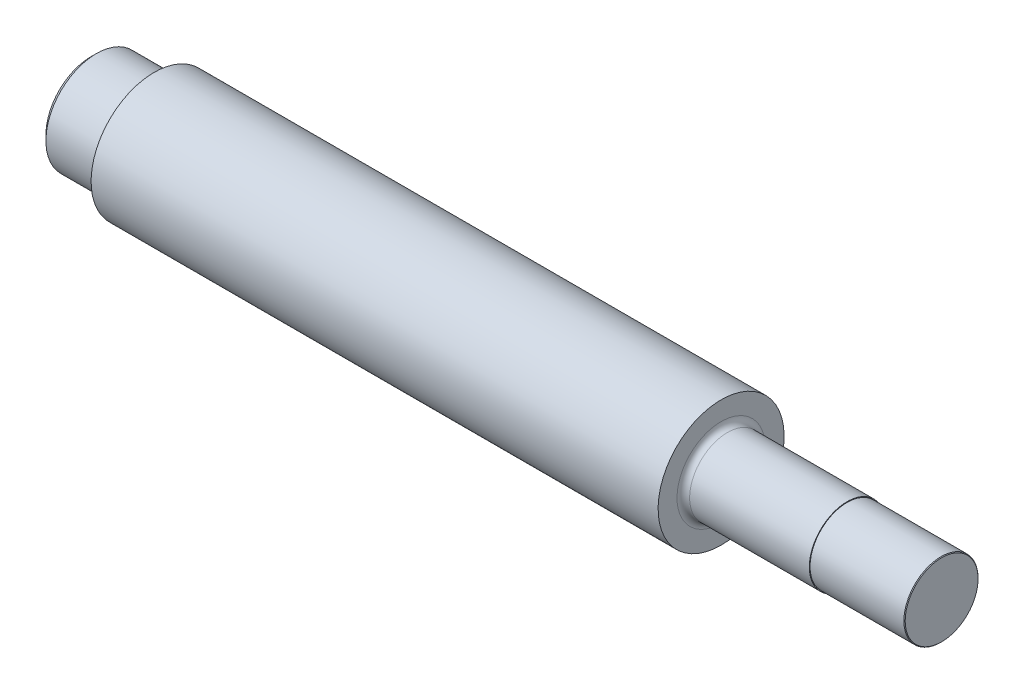
ISO-10303-21;
HEADER;
FILE_DESCRIPTION(('STEP AP214'),'2;1');
FILE_NAME('part.step','',(''),(''),'','','');
FILE_SCHEMA(('AUTOMOTIVE_DESIGN { 1 0 10303 214 1 1 1 1 }'));
ENDSEC;
DATA;
#1=APPLICATION_CONTEXT('core data for automotive mechanical design processes');
#2=APPLICATION_PROTOCOL_DEFINITION('international standard','automotive_design',2000,#1);
#3=PRODUCT_CONTEXT('',#1,'mechanical');
#4=PRODUCT('Part','Part','',(#3));
#5=PRODUCT_RELATED_PRODUCT_CATEGORY('part','',(#4));
#6=PRODUCT_DEFINITION_FORMATION('','',#4);
#7=PRODUCT_DEFINITION_CONTEXT('part definition',#1,'design');
#8=PRODUCT_DEFINITION('design','',#6,#7);
#9=PRODUCT_DEFINITION_SHAPE('','',#8);
#10=(LENGTH_UNIT() NAMED_UNIT(*) SI_UNIT(.MILLI.,.METRE.));
#11=(NAMED_UNIT(*) PLANE_ANGLE_UNIT() SI_UNIT($,.RADIAN.));
#12=(NAMED_UNIT(*) SI_UNIT($,.STERADIAN.) SOLID_ANGLE_UNIT());
#13=UNCERTAINTY_MEASURE_WITH_UNIT(LENGTH_MEASURE(1.E-05),#10,'distance_accuracy_value','');
#14=(GEOMETRIC_REPRESENTATION_CONTEXT(3) GLOBAL_UNCERTAINTY_ASSIGNED_CONTEXT((#13)) GLOBAL_UNIT_ASSIGNED_CONTEXT((#10,
#11,#12)) REPRESENTATION_CONTEXT('',''));
#15=CARTESIAN_POINT('',(0.,0.,0.));
#16=DIRECTION('',(0.,0.,1.));
#17=DIRECTION('',(1.,0.,0.));
#18=AXIS2_PLACEMENT_3D('',#15,#16,#17);
#19=CARTESIAN_POINT('',(-91.494037708377,0.,0.));
#20=DIRECTION('',(-1.,0.,0.));
#21=DIRECTION('',(0.,-1.,0.));
#22=AXIS2_PLACEMENT_3D('',#19,#20,#21);
#23=CYLINDRICAL_SURFACE('',#22,10.);
#24=CARTESIAN_POINT('',(-81.494037708377,0.,0.));
#25=DIRECTION('',(1.,0.,0.));
#26=DIRECTION('',(0.,0.,-1.));
#27=AXIS2_PLACEMENT_3D('',#24,#25,#26);
#28=CIRCLE('',#27,9.99999999999999);
#29=CARTESIAN_POINT('',(-81.494037708377,0.,-9.99999999999999));
#30=VERTEX_POINT('',#29);
#31=EDGE_CURVE('E89',#30,#30,#28,.T.);
#32=ORIENTED_EDGE('',*,*,#31,.T.);
#33=EDGE_LOOP('',(#32));
#34=FACE_BOUND('',#33,.T.);
#35=CARTESIAN_POINT('',(8.50596229162298,0.,0.));
#36=DIRECTION('',(-1.,0.,0.));
#37=DIRECTION('',(0.,-1.,0.));
#38=AXIS2_PLACEMENT_3D('',#35,#36,#37);
#39=CIRCLE('',#38,10.);
#40=CARTESIAN_POINT('',(8.50596229162298,-10.,0.));
#41=VERTEX_POINT('',#40);
#42=EDGE_CURVE('E60',#41,#41,#39,.T.);
#43=ORIENTED_EDGE('',*,*,#42,.T.);
#44=EDGE_LOOP('',(#43));
#45=FACE_BOUND('',#44,.T.);
#46=ADVANCED_FACE('F45',(#34,#45),#23,.T.);
#47=CARTESIAN_POINT('',(8.50596229162299,10.,0.));
#48=DIRECTION('',(-1.,0.,0.));
#49=DIRECTION('',(0.,-1.,0.));
#50=AXIS2_PLACEMENT_3D('',#47,#48,#49);
#51=PLANE('',#50);
#52=CARTESIAN_POINT('',(8.50596229162299,0.,0.));
#53=DIRECTION('',(-1.,0.,0.));
#54=DIRECTION('',(0.,-1.,0.));
#55=AXIS2_PLACEMENT_3D('',#52,#53,#54);
#56=CIRCLE('',#55,7.00000000000001);
#57=CARTESIAN_POINT('',(8.50596229162299,-6.99999999999999,0.));
#58=VERTEX_POINT('',#57);
#59=EDGE_CURVE('E53',#58,#58,#56,.T.);
#60=ORIENTED_EDGE('',*,*,#59,.T.);
#61=EDGE_LOOP('',(#60));
#62=FACE_BOUND('',#61,.T.);
#63=ORIENTED_EDGE('',*,*,#42,.F.);
#64=EDGE_LOOP('',(#63));
#65=FACE_BOUND('',#64,.T.);
#66=ADVANCED_FACE('F119',(#62,#65),#51,.F.);
#67=CARTESIAN_POINT('',(-91.494037708377,0.,0.));
#68=DIRECTION('',(-1.,0.,0.));
#69=DIRECTION('',(0.,-1.,0.));
#70=AXIS2_PLACEMENT_3D('',#67,#68,#69);
#71=CYLINDRICAL_SURFACE('',#70,6.00000000000001);
#72=CARTESIAN_POINT('',(28.505962291623,0.,0.));
#73=DIRECTION('',(-1.,0.,0.));
#74=DIRECTION('',(0.,0.,1.));
#75=AXIS2_PLACEMENT_3D('',#72,#73,#74);
#76=CIRCLE('',#75,6.);
#77=CARTESIAN_POINT('',(28.505962291623,0.,6.));
#78=VERTEX_POINT('',#77);
#79=EDGE_CURVE('E73',#78,#78,#76,.T.);
#80=ORIENTED_EDGE('',*,*,#79,.T.);
#81=EDGE_LOOP('',(#80));
#82=FACE_BOUND('',#81,.T.);
#83=CARTESIAN_POINT('',(9.50596229162298,0.,0.));
#84=DIRECTION('',(-1.,0.,0.));
#85=DIRECTION('',(0.,-1.,0.));
#86=AXIS2_PLACEMENT_3D('',#83,#84,#85);
#87=CIRCLE('',#86,6.00000000000001);
#88=CARTESIAN_POINT('',(9.50596229162298,-5.99999999999999,0.));
#89=VERTEX_POINT('',#88);
#90=EDGE_CURVE('E10',#89,#89,#87,.F.);
#91=ORIENTED_EDGE('',*,*,#90,.T.);
#92=EDGE_LOOP('',(#91));
#93=FACE_BOUND('',#92,.T.);
#94=ADVANCED_FACE('F124',(#82,#93),#71,.T.);
#95=CARTESIAN_POINT('',(9.50596229162298,0.,0.));
#96=DIRECTION('',(-1.,0.,0.));
#97=DIRECTION('',(0.,-1.,0.));
#98=AXIS2_PLACEMENT_3D('',#95,#96,#97);
#99=TOROIDAL_SURFACE('',#98,7.00000000000001,1.);
#100=ORIENTED_EDGE('',*,*,#90,.F.);
#101=EDGE_LOOP('',(#100));
#102=FACE_BOUND('',#101,.T.);
#103=ORIENTED_EDGE('',*,*,#59,.F.);
#104=EDGE_LOOP('',(#103));
#105=FACE_BOUND('',#104,.T.);
#106=ADVANCED_FACE('F47',(#102,#105),#99,.F.);
#107=CARTESIAN_POINT('',(43.505962291623,0.,0.));
#108=DIRECTION('',(-1.,0.,0.));
#109=DIRECTION('',(0.,0.,1.));
#110=AXIS2_PLACEMENT_3D('',#107,#108,#109);
#111=CYLINDRICAL_SURFACE('',#110,5.8865);
#112=CARTESIAN_POINT('',(28.505962291623,0.,0.));
#113=DIRECTION('',(-1.,0.,0.));
#114=DIRECTION('',(0.,0.,1.));
#115=AXIS2_PLACEMENT_3D('',#112,#113,#114);
#116=CIRCLE('',#115,5.8865);
#117=CARTESIAN_POINT('',(28.505962291623,0.,5.8865));
#118=VERTEX_POINT('',#117);
#119=EDGE_CURVE('E67',#118,#118,#116,.T.);
#120=ORIENTED_EDGE('',*,*,#119,.F.);
#121=EDGE_LOOP('',(#120));
#122=FACE_BOUND('',#121,.T.);
#123=CARTESIAN_POINT('',(43.404962291623,0.,0.));
#124=DIRECTION('',(-1.,0.,0.));
#125=DIRECTION('',(0.,0.,1.));
#126=AXIS2_PLACEMENT_3D('',#123,#124,#125);
#127=CIRCLE('',#126,5.8865);
#128=CARTESIAN_POINT('',(43.404962291623,0.,5.8865));
#129=VERTEX_POINT('',#128);
#130=EDGE_CURVE('E81',#129,#129,#127,.T.);
#131=ORIENTED_EDGE('',*,*,#130,.T.);
#132=EDGE_LOOP('',(#131));
#133=FACE_BOUND('',#132,.T.);
#134=ADVANCED_FACE('F136',(#122,#133),#111,.T.);
#135=CARTESIAN_POINT('',(28.505962291623,5.88650000000002,0.));
#136=DIRECTION('',(-1.,0.,0.));
#137=DIRECTION('',(0.,0.,1.));
#138=AXIS2_PLACEMENT_3D('',#135,#136,#137);
#139=PLANE('',#138);
#140=ORIENTED_EDGE('',*,*,#79,.F.);
#141=EDGE_LOOP('',(#140));
#142=FACE_BOUND('',#141,.T.);
#143=ORIENTED_EDGE('',*,*,#119,.T.);
#144=EDGE_LOOP('',(#143));
#145=FACE_BOUND('',#144,.T.);
#146=ADVANCED_FACE('F139',(#142,#145),#139,.F.);
#147=CARTESIAN_POINT('',(43.505962291623,0.,0.));
#148=DIRECTION('',(-1.,0.,0.));
#149=DIRECTION('',(0.,0.,1.));
#150=AXIS2_PLACEMENT_3D('',#147,#148,#149);
#151=CONICAL_SURFACE('',#150,5.7855,0.785398163397457);
#152=ORIENTED_EDGE('',*,*,#130,.F.);
#153=EDGE_LOOP('',(#152));
#154=FACE_BOUND('',#153,.T.);
#155=CARTESIAN_POINT('',(43.505962291623,0.,0.));
#156=DIRECTION('',(-1.,0.,0.));
#157=DIRECTION('',(0.,0.,1.));
#158=AXIS2_PLACEMENT_3D('',#155,#156,#157);
#159=CIRCLE('',#158,5.7855);
#160=CARTESIAN_POINT('',(43.505962291623,0.,5.7855));
#161=VERTEX_POINT('',#160);
#162=EDGE_CURVE('E77',#161,#161,#159,.T.);
#163=ORIENTED_EDGE('',*,*,#162,.T.);
#164=EDGE_LOOP('',(#163));
#165=FACE_BOUND('',#164,.T.);
#166=ADVANCED_FACE('F134',(#154,#165),#151,.T.);
#167=CARTESIAN_POINT('',(43.505962291623,6.00000000000002,0.));
#168=DIRECTION('',(-1.,0.,0.));
#169=DIRECTION('',(0.,-1.,0.));
#170=AXIS2_PLACEMENT_3D('',#167,#168,#169);
#171=PLANE('',#170);
#172=ORIENTED_EDGE('',*,*,#162,.F.);
#173=EDGE_LOOP('',(#172));
#174=FACE_BOUND('',#173,.T.);
#175=ADVANCED_FACE('F131',(#174),#171,.F.);
#176=CARTESIAN_POINT('',(-91.494037708377,0.,0.));
#177=DIRECTION('',(1.,0.,0.));
#178=DIRECTION('',(0.,0.,-1.));
#179=AXIS2_PLACEMENT_3D('',#176,#177,#178);
#180=CYLINDRICAL_SURFACE('',#179,8.);
#181=CARTESIAN_POINT('',(-81.494037708377,0.,0.));
#182=DIRECTION('',(1.,0.,0.));
#183=DIRECTION('',(0.,0.,-1.));
#184=AXIS2_PLACEMENT_3D('',#181,#182,#183);
#185=CIRCLE('',#184,8.);
#186=CARTESIAN_POINT('',(-81.494037708377,0.,-8.));
#187=VERTEX_POINT('',#186);
#188=EDGE_CURVE('E85',#187,#187,#185,.T.);
#189=ORIENTED_EDGE('',*,*,#188,.F.);
#190=EDGE_LOOP('',(#189));
#191=FACE_BOUND('',#190,.T.);
#192=CARTESIAN_POINT('',(-90.666037708377,0.,0.));
#193=DIRECTION('',(1.,0.,0.));
#194=DIRECTION('',(0.,0.,-1.));
#195=AXIS2_PLACEMENT_3D('',#192,#193,#194);
#196=CIRCLE('',#195,8.);
#197=CARTESIAN_POINT('',(-90.666037708377,0.,-8.));
#198=VERTEX_POINT('',#197);
#199=EDGE_CURVE('E97',#198,#198,#196,.T.);
#200=ORIENTED_EDGE('',*,*,#199,.T.);
#201=EDGE_LOOP('',(#200));
#202=FACE_BOUND('',#201,.T.);
#203=ADVANCED_FACE('F104',(#191,#202),#180,.T.);
#204=CARTESIAN_POINT('',(-81.494037708377,8.,0.));
#205=DIRECTION('',(1.,0.,0.));
#206=DIRECTION('',(0.,0.,-1.));
#207=AXIS2_PLACEMENT_3D('',#204,#205,#206);
#208=PLANE('',#207);
#209=ORIENTED_EDGE('',*,*,#31,.F.);
#210=EDGE_LOOP('',(#209));
#211=FACE_BOUND('',#210,.T.);
#212=ORIENTED_EDGE('',*,*,#188,.T.);
#213=EDGE_LOOP('',(#212));
#214=FACE_BOUND('',#213,.T.);
#215=ADVANCED_FACE('F110',(#211,#214),#208,.F.);
#216=CARTESIAN_POINT('',(-91.494037708377,0.,0.));
#217=DIRECTION('',(1.,0.,0.));
#218=DIRECTION('',(0.,0.,-1.));
#219=AXIS2_PLACEMENT_3D('',#216,#217,#218);
#220=CONICAL_SURFACE('',#219,7.172,0.78539816339745);
#221=ORIENTED_EDGE('',*,*,#199,.F.);
#222=EDGE_LOOP('',(#221));
#223=FACE_BOUND('',#222,.T.);
#224=CARTESIAN_POINT('',(-91.494037708377,0.,0.));
#225=DIRECTION('',(1.,0.,0.));
#226=DIRECTION('',(0.,0.,-1.));
#227=AXIS2_PLACEMENT_3D('',#224,#225,#226);
#228=CIRCLE('',#227,7.172);
#229=CARTESIAN_POINT('',(-91.494037708377,0.,-7.172));
#230=VERTEX_POINT('',#229);
#231=EDGE_CURVE('E93',#230,#230,#228,.T.);
#232=ORIENTED_EDGE('',*,*,#231,.T.);
#233=EDGE_LOOP('',(#232));
#234=FACE_BOUND('',#233,.T.);
#235=ADVANCED_FACE('F106',(#223,#234),#220,.T.);
#236=CARTESIAN_POINT('',(-91.494037708377,0.,0.));
#237=DIRECTION('',(1.,0.,0.));
#238=DIRECTION('',(0.,1.,0.));
#239=AXIS2_PLACEMENT_3D('',#236,#237,#238);
#240=PLANE('',#239);
#241=ORIENTED_EDGE('',*,*,#231,.F.);
#242=EDGE_LOOP('',(#241));
#243=FACE_BOUND('',#242,.T.);
#244=ADVANCED_FACE('F109',(#243),#240,.F.);
#245=CLOSED_SHELL('',(#46,#66,#94,#106,#134,#146,#166,#175,#203,#215,#235,#244));
#246=MANIFOLD_SOLID_BREP('B2',#245);
#247=ADVANCED_BREP_SHAPE_REPRESENTATION('',(#18,#246),#14);
#248=SHAPE_DEFINITION_REPRESENTATION(#9,#247);
ENDSEC;
END-ISO-10303-21;
